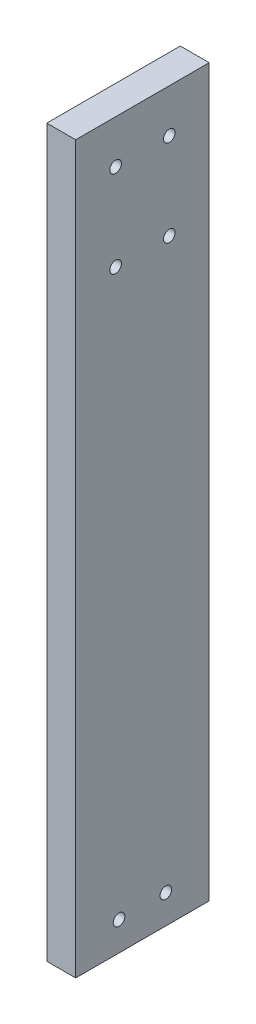
ISO-10303-21;
HEADER;
FILE_DESCRIPTION(('STEP AP214'),'2;1');
FILE_NAME('part.step','',(''),(''),'','','');
FILE_SCHEMA(('AUTOMOTIVE_DESIGN { 1 0 10303 214 1 1 1 1 }'));
ENDSEC;
DATA;
#1=APPLICATION_CONTEXT('core data for automotive mechanical design processes');
#2=APPLICATION_PROTOCOL_DEFINITION('international standard','automotive_design',2000,#1);
#3=PRODUCT_CONTEXT('',#1,'mechanical');
#4=PRODUCT('Part','Part','',(#3));
#5=PRODUCT_RELATED_PRODUCT_CATEGORY('part','',(#4));
#6=PRODUCT_DEFINITION_FORMATION('','',#4);
#7=PRODUCT_DEFINITION_CONTEXT('part definition',#1,'design');
#8=PRODUCT_DEFINITION('design','',#6,#7);
#9=PRODUCT_DEFINITION_SHAPE('','',#8);
#10=(LENGTH_UNIT() NAMED_UNIT(*) SI_UNIT(.MILLI.,.METRE.));
#11=(NAMED_UNIT(*) PLANE_ANGLE_UNIT() SI_UNIT($,.RADIAN.));
#12=(NAMED_UNIT(*) SI_UNIT($,.STERADIAN.) SOLID_ANGLE_UNIT());
#13=UNCERTAINTY_MEASURE_WITH_UNIT(LENGTH_MEASURE(1.E-05),#10,'distance_accuracy_value','');
#14=(GEOMETRIC_REPRESENTATION_CONTEXT(3) GLOBAL_UNCERTAINTY_ASSIGNED_CONTEXT((#13)) GLOBAL_UNIT_ASSIGNED_CONTEXT((#10,
#11,#12)) REPRESENTATION_CONTEXT('',''));
#15=CARTESIAN_POINT('',(0.,0.,0.));
#16=DIRECTION('',(0.,0.,1.));
#17=DIRECTION('',(1.,0.,0.));
#18=AXIS2_PLACEMENT_3D('',#15,#16,#17);
#19=CARTESIAN_POINT('',(0.,-319.024,0.));
#20=DIRECTION('',(-1.,0.,0.));
#21=DIRECTION('',(0.,0.,1.));
#22=AXIS2_PLACEMENT_3D('',#19,#20,#21);
#23=PLANE('',#22);
#24=CARTESIAN_POINT('',(0.,-306.324,-19.05));
#25=DIRECTION('',(-1.,0.,0.));
#26=DIRECTION('',(0.,0.,1.));
#27=AXIS2_PLACEMENT_3D('',#24,#25,#26);
#28=CIRCLE('',#27,2.55270000000002);
#29=CARTESIAN_POINT('',(0.,-306.324,-16.4973));
#30=VERTEX_POINT('',#29);
#31=EDGE_CURVE('E165',#30,#30,#28,.T.);
#32=ORIENTED_EDGE('',*,*,#31,.F.);
#33=EDGE_LOOP('',(#32));
#34=FACE_BOUND('',#33,.T.);
#35=CARTESIAN_POINT('',(0.,-306.324,-39.624));
#36=DIRECTION('',(-1.,0.,0.));
#37=DIRECTION('',(0.,0.,1.));
#38=AXIS2_PLACEMENT_3D('',#35,#36,#37);
#39=CIRCLE('',#38,2.55270000000002);
#40=CARTESIAN_POINT('',(0.,-306.324,-37.0713));
#41=VERTEX_POINT('',#40);
#42=EDGE_CURVE('E167',#41,#41,#39,.T.);
#43=ORIENTED_EDGE('',*,*,#42,.F.);
#44=EDGE_LOOP('',(#43));
#45=FACE_BOUND('',#44,.T.);
#46=CARTESIAN_POINT('',(0.,-19.05,-41.148));
#47=DIRECTION('',(-1.,0.,0.));
#48=DIRECTION('',(0.,0.,1.));
#49=AXIS2_PLACEMENT_3D('',#46,#47,#48);
#50=CIRCLE('',#49,2.5527);
#51=CARTESIAN_POINT('',(0.,-19.05,-38.5953));
#52=VERTEX_POINT('',#51);
#53=EDGE_CURVE('E175',#52,#52,#50,.T.);
#54=ORIENTED_EDGE('',*,*,#53,.F.);
#55=EDGE_LOOP('',(#54));
#56=FACE_BOUND('',#55,.T.);
#57=CARTESIAN_POINT('',(0.,-19.05,-17.526));
#58=DIRECTION('',(-1.,0.,0.));
#59=DIRECTION('',(0.,0.,1.));
#60=AXIS2_PLACEMENT_3D('',#57,#58,#59);
#61=CIRCLE('',#60,2.5527);
#62=CARTESIAN_POINT('',(0.,-19.05,-14.9733));
#63=VERTEX_POINT('',#62);
#64=EDGE_CURVE('E181',#63,#63,#61,.T.);
#65=ORIENTED_EDGE('',*,*,#64,.F.);
#66=EDGE_LOOP('',(#65));
#67=FACE_BOUND('',#66,.T.);
#68=CARTESIAN_POINT('',(0.,-57.15,-41.148));
#69=DIRECTION('',(-1.,0.,0.));
#70=DIRECTION('',(0.,0.,1.));
#71=AXIS2_PLACEMENT_3D('',#68,#69,#70);
#72=CIRCLE('',#71,2.5527);
#73=CARTESIAN_POINT('',(0.,-57.15,-38.5953));
#74=VERTEX_POINT('',#73);
#75=EDGE_CURVE('E187',#74,#74,#72,.T.);
#76=ORIENTED_EDGE('',*,*,#75,.F.);
#77=EDGE_LOOP('',(#76));
#78=FACE_BOUND('',#77,.T.);
#79=CARTESIAN_POINT('',(0.,-57.15,-17.526));
#80=DIRECTION('',(-1.,0.,0.));
#81=DIRECTION('',(0.,0.,1.));
#82=AXIS2_PLACEMENT_3D('',#79,#80,#81);
#83=CIRCLE('',#82,2.5527);
#84=CARTESIAN_POINT('',(0.,-57.15,-14.9733));
#85=VERTEX_POINT('',#84);
#86=EDGE_CURVE('E193',#85,#85,#83,.T.);
#87=ORIENTED_EDGE('',*,*,#86,.F.);
#88=EDGE_LOOP('',(#87));
#89=FACE_BOUND('',#88,.T.);
#90=DIRECTION('',(0.,0.,1.));
#91=VECTOR('',#90,1.);
#92=CARTESIAN_POINT('',(0.,0.,0.));
#93=LINE('',#92,#91);
#94=CARTESIAN_POINT('',(0.,0.,-58.674));
#95=VERTEX_POINT('',#94);
#96=CARTESIAN_POINT('',(0.,0.,0.));
#97=VERTEX_POINT('',#96);
#98=EDGE_CURVE('E103',#95,#97,#93,.T.);
#99=ORIENTED_EDGE('',*,*,#98,.F.);
#100=DIRECTION('',(0.,1.,0.));
#101=VECTOR('',#100,1.);
#102=CARTESIAN_POINT('',(0.,-319.024,-58.674));
#103=LINE('',#102,#101);
#104=CARTESIAN_POINT('',(0.,-319.024,-58.674));
#105=VERTEX_POINT('',#104);
#106=EDGE_CURVE('E11',#105,#95,#103,.T.);
#107=ORIENTED_EDGE('',*,*,#106,.F.);
#108=DIRECTION('',(0.,0.,1.));
#109=VECTOR('',#108,1.);
#110=CARTESIAN_POINT('',(0.,-319.024,0.));
#111=LINE('',#110,#109);
#112=CARTESIAN_POINT('',(0.,-319.024,0.));
#113=VERTEX_POINT('',#112);
#114=EDGE_CURVE('E96',#105,#113,#111,.T.);
#115=ORIENTED_EDGE('',*,*,#114,.T.);
#116=DIRECTION('',(0.,1.,0.));
#117=VECTOR('',#116,1.);
#118=CARTESIAN_POINT('',(0.,-319.024,0.));
#119=LINE('',#118,#117);
#120=EDGE_CURVE('E41',#113,#97,#119,.T.);
#121=ORIENTED_EDGE('',*,*,#120,.T.);
#122=EDGE_LOOP('',(#99,#107,#115,#121));
#123=FACE_BOUND('',#122,.T.);
#124=ADVANCED_FACE('F38',(#34,#45,#56,#67,#78,#89,#123),#23,.T.);
#125=CARTESIAN_POINT('',(0.,-319.024,-58.674));
#126=DIRECTION('',(0.,0.,-1.));
#127=DIRECTION('',(-1.,0.,0.));
#128=AXIS2_PLACEMENT_3D('',#125,#126,#127);
#129=PLANE('',#128);
#130=DIRECTION('',(-1.,0.,0.));
#131=VECTOR('',#130,1.);
#132=CARTESIAN_POINT('',(0.,0.,-58.674));
#133=LINE('',#132,#131);
#134=CARTESIAN_POINT('',(12.7,0.,-58.674));
#135=VERTEX_POINT('',#134);
#136=EDGE_CURVE('E98',#135,#95,#133,.T.);
#137=ORIENTED_EDGE('',*,*,#136,.F.);
#138=DIRECTION('',(0.,1.,0.));
#139=VECTOR('',#138,1.);
#140=CARTESIAN_POINT('',(12.7,-319.024,-58.674));
#141=LINE('',#140,#139);
#142=CARTESIAN_POINT('',(12.7,-319.024,-58.674));
#143=VERTEX_POINT('',#142);
#144=EDGE_CURVE('E47',#143,#135,#141,.T.);
#145=ORIENTED_EDGE('',*,*,#144,.F.);
#146=DIRECTION('',(-1.,0.,0.));
#147=VECTOR('',#146,1.);
#148=CARTESIAN_POINT('',(0.,-319.024,-58.674));
#149=LINE('',#148,#147);
#150=EDGE_CURVE('E93',#143,#105,#149,.T.);
#151=ORIENTED_EDGE('',*,*,#150,.T.);
#152=ORIENTED_EDGE('',*,*,#106,.T.);
#153=EDGE_LOOP('',(#137,#145,#151,#152));
#154=FACE_BOUND('',#153,.T.);
#155=ADVANCED_FACE('F114',(#154),#129,.T.);
#156=CARTESIAN_POINT('',(12.7,-319.024,0.));
#157=DIRECTION('',(1.,0.,0.));
#158=DIRECTION('',(0.,0.,-1.));
#159=AXIS2_PLACEMENT_3D('',#156,#157,#158);
#160=PLANE('',#159);
#161=CARTESIAN_POINT('',(12.7,-306.324,-19.05));
#162=DIRECTION('',(-1.,0.,0.));
#163=DIRECTION('',(0.,0.,1.));
#164=AXIS2_PLACEMENT_3D('',#161,#162,#163);
#165=CIRCLE('',#164,2.55270000000002);
#166=CARTESIAN_POINT('',(12.7,-306.324,-16.4973));
#167=VERTEX_POINT('',#166);
#168=EDGE_CURVE('E162',#167,#167,#165,.T.);
#169=ORIENTED_EDGE('',*,*,#168,.T.);
#170=EDGE_LOOP('',(#169));
#171=FACE_BOUND('',#170,.T.);
#172=CARTESIAN_POINT('',(12.7,-306.324,-39.624));
#173=DIRECTION('',(-1.,0.,0.));
#174=DIRECTION('',(0.,0.,1.));
#175=AXIS2_PLACEMENT_3D('',#172,#173,#174);
#176=CIRCLE('',#175,2.55270000000002);
#177=CARTESIAN_POINT('',(12.7,-306.324,-37.0713));
#178=VERTEX_POINT('',#177);
#179=EDGE_CURVE('E172',#178,#178,#176,.T.);
#180=ORIENTED_EDGE('',*,*,#179,.T.);
#181=EDGE_LOOP('',(#180));
#182=FACE_BOUND('',#181,.T.);
#183=CARTESIAN_POINT('',(12.7,-19.05,-41.148));
#184=DIRECTION('',(-1.,0.,0.));
#185=DIRECTION('',(0.,0.,1.));
#186=AXIS2_PLACEMENT_3D('',#183,#184,#185);
#187=CIRCLE('',#186,2.5527);
#188=CARTESIAN_POINT('',(12.7,-19.05,-38.5953));
#189=VERTEX_POINT('',#188);
#190=EDGE_CURVE('E178',#189,#189,#187,.T.);
#191=ORIENTED_EDGE('',*,*,#190,.T.);
#192=EDGE_LOOP('',(#191));
#193=FACE_BOUND('',#192,.T.);
#194=CARTESIAN_POINT('',(12.7,-19.05,-17.526));
#195=DIRECTION('',(-1.,0.,0.));
#196=DIRECTION('',(0.,0.,1.));
#197=AXIS2_PLACEMENT_3D('',#194,#195,#196);
#198=CIRCLE('',#197,2.5527);
#199=CARTESIAN_POINT('',(12.7,-19.05,-14.9733));
#200=VERTEX_POINT('',#199);
#201=EDGE_CURVE('E184',#200,#200,#198,.T.);
#202=ORIENTED_EDGE('',*,*,#201,.T.);
#203=EDGE_LOOP('',(#202));
#204=FACE_BOUND('',#203,.T.);
#205=CARTESIAN_POINT('',(12.7,-57.15,-41.148));
#206=DIRECTION('',(-1.,0.,0.));
#207=DIRECTION('',(0.,0.,1.));
#208=AXIS2_PLACEMENT_3D('',#205,#206,#207);
#209=CIRCLE('',#208,2.5527);
#210=CARTESIAN_POINT('',(12.7,-57.15,-38.5953));
#211=VERTEX_POINT('',#210);
#212=EDGE_CURVE('E190',#211,#211,#209,.T.);
#213=ORIENTED_EDGE('',*,*,#212,.T.);
#214=EDGE_LOOP('',(#213));
#215=FACE_BOUND('',#214,.T.);
#216=CARTESIAN_POINT('',(12.7,-57.15,-17.526));
#217=DIRECTION('',(-1.,0.,0.));
#218=DIRECTION('',(0.,0.,1.));
#219=AXIS2_PLACEMENT_3D('',#216,#217,#218);
#220=CIRCLE('',#219,2.5527);
#221=CARTESIAN_POINT('',(12.7,-57.15,-14.9733));
#222=VERTEX_POINT('',#221);
#223=EDGE_CURVE('E107',#222,#222,#220,.T.);
#224=ORIENTED_EDGE('',*,*,#223,.T.);
#225=EDGE_LOOP('',(#224));
#226=FACE_BOUND('',#225,.T.);
#227=DIRECTION('',(0.,0.,-1.));
#228=VECTOR('',#227,1.);
#229=CARTESIAN_POINT('',(12.7,0.,0.));
#230=LINE('',#229,#228);
#231=CARTESIAN_POINT('',(12.7,0.,0.));
#232=VERTEX_POINT('',#231);
#233=EDGE_CURVE('E88',#232,#135,#230,.T.);
#234=ORIENTED_EDGE('',*,*,#233,.F.);
#235=DIRECTION('',(0.,1.,0.));
#236=VECTOR('',#235,1.);
#237=CARTESIAN_POINT('',(12.7,-319.024,0.));
#238=LINE('',#237,#236);
#239=CARTESIAN_POINT('',(12.7,-319.024,0.));
#240=VERTEX_POINT('',#239);
#241=EDGE_CURVE('E83',#240,#232,#238,.T.);
#242=ORIENTED_EDGE('',*,*,#241,.F.);
#243=DIRECTION('',(0.,0.,-1.));
#244=VECTOR('',#243,1.);
#245=CARTESIAN_POINT('',(12.7,-319.024,0.));
#246=LINE('',#245,#244);
#247=EDGE_CURVE('E86',#240,#143,#246,.T.);
#248=ORIENTED_EDGE('',*,*,#247,.T.);
#249=ORIENTED_EDGE('',*,*,#144,.T.);
#250=EDGE_LOOP('',(#234,#242,#248,#249));
#251=FACE_BOUND('',#250,.T.);
#252=ADVANCED_FACE('F85',(#171,#182,#193,#204,#215,#226,#251),#160,.T.);
#253=CARTESIAN_POINT('',(0.,-319.024,0.));
#254=DIRECTION('',(0.,0.,1.));
#255=DIRECTION('',(1.,0.,0.));
#256=AXIS2_PLACEMENT_3D('',#253,#254,#255);
#257=PLANE('',#256);
#258=DIRECTION('',(1.,0.,0.));
#259=VECTOR('',#258,1.);
#260=CARTESIAN_POINT('',(0.,0.,0.));
#261=LINE('',#260,#259);
#262=EDGE_CURVE('E106',#97,#232,#261,.T.);
#263=ORIENTED_EDGE('',*,*,#262,.F.);
#264=ORIENTED_EDGE('',*,*,#120,.F.);
#265=DIRECTION('',(1.,0.,0.));
#266=VECTOR('',#265,1.);
#267=CARTESIAN_POINT('',(0.,-319.024,0.));
#268=LINE('',#267,#266);
#269=EDGE_CURVE('E92',#113,#240,#268,.T.);
#270=ORIENTED_EDGE('',*,*,#269,.T.);
#271=ORIENTED_EDGE('',*,*,#241,.T.);
#272=EDGE_LOOP('',(#263,#264,#270,#271));
#273=FACE_BOUND('',#272,.T.);
#274=ADVANCED_FACE('F95',(#273),#257,.T.);
#275=CARTESIAN_POINT('',(0.,-319.024,0.));
#276=DIRECTION('',(0.,-1.,0.));
#277=DIRECTION('',(0.,0.,-1.));
#278=AXIS2_PLACEMENT_3D('',#275,#276,#277);
#279=PLANE('',#278);
#280=ORIENTED_EDGE('',*,*,#114,.F.);
#281=ORIENTED_EDGE('',*,*,#150,.F.);
#282=ORIENTED_EDGE('',*,*,#247,.F.);
#283=ORIENTED_EDGE('',*,*,#269,.F.);
#284=EDGE_LOOP('',(#280,#281,#282,#283));
#285=FACE_BOUND('',#284,.T.);
#286=ADVANCED_FACE('F91',(#285),#279,.T.);
#287=CARTESIAN_POINT('',(0.,0.,0.));
#288=DIRECTION('',(0.,-1.,0.));
#289=DIRECTION('',(0.,0.,-1.));
#290=AXIS2_PLACEMENT_3D('',#287,#288,#289);
#291=PLANE('',#290);
#292=ORIENTED_EDGE('',*,*,#98,.T.);
#293=ORIENTED_EDGE('',*,*,#262,.T.);
#294=ORIENTED_EDGE('',*,*,#233,.T.);
#295=ORIENTED_EDGE('',*,*,#136,.T.);
#296=EDGE_LOOP('',(#292,#293,#294,#295));
#297=FACE_BOUND('',#296,.T.);
#298=ADVANCED_FACE('F113',(#297),#291,.F.);
#299=CARTESIAN_POINT('',(0.,-57.15,-17.526));
#300=DIRECTION('',(-1.,0.,0.));
#301=DIRECTION('',(0.,0.,1.));
#302=AXIS2_PLACEMENT_3D('',#299,#300,#301);
#303=CYLINDRICAL_SURFACE('',#302,2.5527);
#304=ORIENTED_EDGE('',*,*,#223,.F.);
#305=EDGE_LOOP('',(#304));
#306=FACE_BOUND('',#305,.T.);
#307=ORIENTED_EDGE('',*,*,#86,.T.);
#308=EDGE_LOOP('',(#307));
#309=FACE_BOUND('',#308,.T.);
#310=ADVANCED_FACE('F133',(#306,#309),#303,.F.);
#311=CARTESIAN_POINT('',(0.,-57.15,-41.148));
#312=DIRECTION('',(-1.,0.,0.));
#313=DIRECTION('',(0.,0.,1.));
#314=AXIS2_PLACEMENT_3D('',#311,#312,#313);
#315=CYLINDRICAL_SURFACE('',#314,2.5527);
#316=ORIENTED_EDGE('',*,*,#212,.F.);
#317=EDGE_LOOP('',(#316));
#318=FACE_BOUND('',#317,.T.);
#319=ORIENTED_EDGE('',*,*,#75,.T.);
#320=EDGE_LOOP('',(#319));
#321=FACE_BOUND('',#320,.T.);
#322=ADVANCED_FACE('F137',(#318,#321),#315,.F.);
#323=CARTESIAN_POINT('',(0.,-19.05,-17.526));
#324=DIRECTION('',(-1.,0.,0.));
#325=DIRECTION('',(0.,0.,1.));
#326=AXIS2_PLACEMENT_3D('',#323,#324,#325);
#327=CYLINDRICAL_SURFACE('',#326,2.5527);
#328=ORIENTED_EDGE('',*,*,#201,.F.);
#329=EDGE_LOOP('',(#328));
#330=FACE_BOUND('',#329,.T.);
#331=ORIENTED_EDGE('',*,*,#64,.T.);
#332=EDGE_LOOP('',(#331));
#333=FACE_BOUND('',#332,.T.);
#334=ADVANCED_FACE('F141',(#330,#333),#327,.F.);
#335=CARTESIAN_POINT('',(0.,-19.05,-41.148));
#336=DIRECTION('',(-1.,0.,0.));
#337=DIRECTION('',(0.,0.,1.));
#338=AXIS2_PLACEMENT_3D('',#335,#336,#337);
#339=CYLINDRICAL_SURFACE('',#338,2.5527);
#340=ORIENTED_EDGE('',*,*,#190,.F.);
#341=EDGE_LOOP('',(#340));
#342=FACE_BOUND('',#341,.T.);
#343=ORIENTED_EDGE('',*,*,#53,.T.);
#344=EDGE_LOOP('',(#343));
#345=FACE_BOUND('',#344,.T.);
#346=ADVANCED_FACE('F145',(#342,#345),#339,.F.);
#347=CARTESIAN_POINT('',(0.,-306.324,-39.624));
#348=DIRECTION('',(-1.,0.,0.));
#349=DIRECTION('',(0.,0.,1.));
#350=AXIS2_PLACEMENT_3D('',#347,#348,#349);
#351=CYLINDRICAL_SURFACE('',#350,2.55270000000002);
#352=ORIENTED_EDGE('',*,*,#179,.F.);
#353=EDGE_LOOP('',(#352));
#354=FACE_BOUND('',#353,.T.);
#355=ORIENTED_EDGE('',*,*,#42,.T.);
#356=EDGE_LOOP('',(#355));
#357=FACE_BOUND('',#356,.T.);
#358=ADVANCED_FACE('F149',(#354,#357),#351,.F.);
#359=CARTESIAN_POINT('',(0.,-306.324,-19.05));
#360=DIRECTION('',(-1.,0.,0.));
#361=DIRECTION('',(0.,0.,1.));
#362=AXIS2_PLACEMENT_3D('',#359,#360,#361);
#363=CYLINDRICAL_SURFACE('',#362,2.55270000000002);
#364=ORIENTED_EDGE('',*,*,#168,.F.);
#365=EDGE_LOOP('',(#364));
#366=FACE_BOUND('',#365,.T.);
#367=ORIENTED_EDGE('',*,*,#31,.T.);
#368=EDGE_LOOP('',(#367));
#369=FACE_BOUND('',#368,.T.);
#370=ADVANCED_FACE('F153',(#366,#369),#363,.F.);
#371=CLOSED_SHELL('',(#124,#155,#252,#274,#286,#298,#310,#322,#334,#346,#358,#370));
#372=MANIFOLD_SOLID_BREP('B2',#371);
#373=ADVANCED_BREP_SHAPE_REPRESENTATION('',(#18,#372),#14);
#374=SHAPE_DEFINITION_REPRESENTATION(#9,#373);
ENDSEC;
END-ISO-10303-21;
